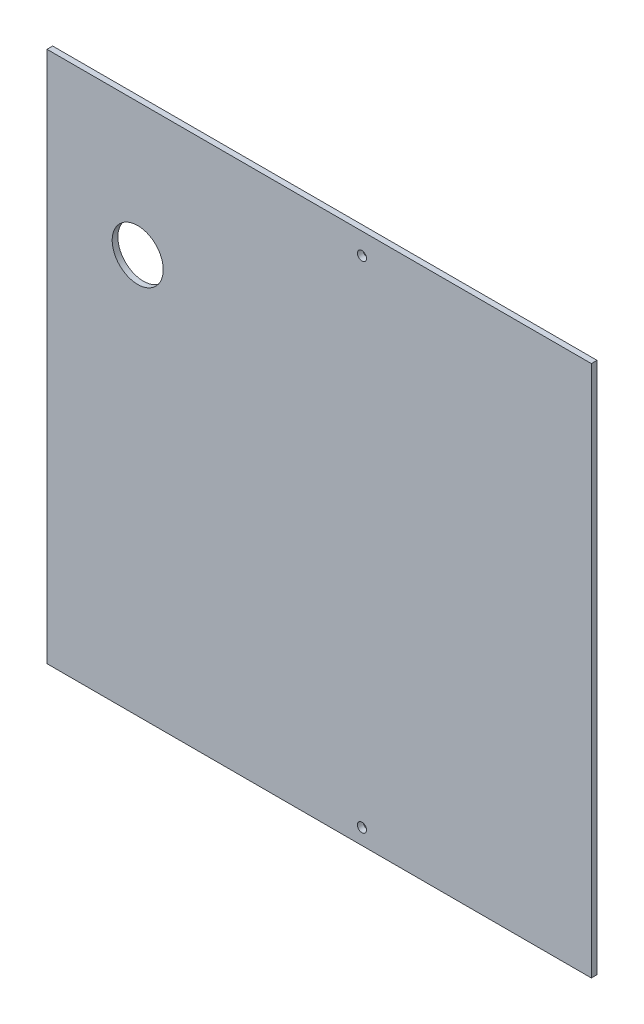
ISO-10303-21;
HEADER;
FILE_DESCRIPTION(('STEP AP214'),'2;1');
FILE_NAME('part.step','',(''),(''),'','','');
FILE_SCHEMA(('AUTOMOTIVE_DESIGN { 1 0 10303 214 1 1 1 1 }'));
ENDSEC;
DATA;
#1=APPLICATION_CONTEXT('core data for automotive mechanical design processes');
#2=APPLICATION_PROTOCOL_DEFINITION('international standard','automotive_design',2000,#1);
#3=PRODUCT_CONTEXT('',#1,'mechanical');
#4=PRODUCT('Part','Part','',(#3));
#5=PRODUCT_RELATED_PRODUCT_CATEGORY('part','',(#4));
#6=PRODUCT_DEFINITION_FORMATION('','',#4);
#7=PRODUCT_DEFINITION_CONTEXT('part definition',#1,'design');
#8=PRODUCT_DEFINITION('design','',#6,#7);
#9=PRODUCT_DEFINITION_SHAPE('','',#8);
#10=(LENGTH_UNIT() NAMED_UNIT(*) SI_UNIT(.MILLI.,.METRE.));
#11=(NAMED_UNIT(*) PLANE_ANGLE_UNIT() SI_UNIT($,.RADIAN.));
#12=(NAMED_UNIT(*) SI_UNIT($,.STERADIAN.) SOLID_ANGLE_UNIT());
#13=UNCERTAINTY_MEASURE_WITH_UNIT(LENGTH_MEASURE(1.E-05),#10,'distance_accuracy_value','');
#14=(GEOMETRIC_REPRESENTATION_CONTEXT(3) GLOBAL_UNCERTAINTY_ASSIGNED_CONTEXT((#13)) GLOBAL_UNIT_ASSIGNED_CONTEXT((#10,
#11,#12)) REPRESENTATION_CONTEXT('',''));
#15=CARTESIAN_POINT('',(0.,0.,0.));
#16=DIRECTION('',(0.,0.,1.));
#17=DIRECTION('',(1.,0.,0.));
#18=AXIS2_PLACEMENT_3D('',#15,#16,#17);
#19=CARTESIAN_POINT('',(0.,0.,-3.175));
#20=DIRECTION('',(0.,0.,-1.));
#21=DIRECTION('',(-1.,0.,0.));
#22=AXIS2_PLACEMENT_3D('',#19,#20,#21);
#23=PLANE('',#22);
#24=CARTESIAN_POINT('',(50.8,203.2,-3.175));
#25=DIRECTION('',(0.,0.,1.));
#26=DIRECTION('',(1.,0.,0.));
#27=AXIS2_PLACEMENT_3D('',#24,#25,#26);
#28=CIRCLE('',#27,14.2875);
#29=CARTESIAN_POINT('',(65.0875,203.2,-3.175));
#30=VERTEX_POINT('',#29);
#31=EDGE_CURVE('E136',#30,#30,#28,.T.);
#32=ORIENTED_EDGE('',*,*,#31,.T.);
#33=EDGE_LOOP('',(#32));
#34=FACE_BOUND('',#33,.T.);
#35=DIRECTION('',(0.,1.,0.));
#36=VECTOR('',#35,1.);
#37=CARTESIAN_POINT('',(304.8,0.,-3.175));
#38=LINE('',#37,#36);
#39=CARTESIAN_POINT('',(304.8,-20.3796504257165,-3.17500000000015));
#40=VERTEX_POINT('',#39);
#41=CARTESIAN_POINT('',(304.8,277.554650425716,-3.17500000000021));
#42=VERTEX_POINT('',#41);
#43=EDGE_CURVE('E13',#40,#42,#38,.T.);
#44=ORIENTED_EDGE('',*,*,#43,.F.);
#45=DIRECTION('',(1.,0.,0.));
#46=VECTOR('',#45,1.);
#47=CARTESIAN_POINT('',(304.8,-20.3796504257165,-3.17500000000015));
#48=LINE('',#47,#46);
#49=CARTESIAN_POINT('',(-1.11022302462516E-13,-20.3796504257165,-3.17500000000015));
#50=VERTEX_POINT('',#49);
#51=EDGE_CURVE('E148',#50,#40,#48,.T.);
#52=ORIENTED_EDGE('',*,*,#51,.F.);
#53=DIRECTION('',(0.,-1.,0.));
#54=VECTOR('',#53,1.);
#55=CARTESIAN_POINT('',(0.,0.,-3.175));
#56=LINE('',#55,#54);
#57=CARTESIAN_POINT('',(0.,277.554650425716,-3.17500000000021));
#58=VERTEX_POINT('',#57);
#59=EDGE_CURVE('E93',#58,#50,#56,.T.);
#60=ORIENTED_EDGE('',*,*,#59,.F.);
#61=DIRECTION('',(-1.,0.,0.));
#62=VECTOR('',#61,1.);
#63=CARTESIAN_POINT('',(0.,277.554650425716,-3.17500000000021));
#64=LINE('',#63,#62);
#65=EDGE_CURVE('E141',#42,#58,#64,.T.);
#66=ORIENTED_EDGE('',*,*,#65,.F.);
#67=EDGE_LOOP('',(#44,#52,#60,#66));
#68=FACE_BOUND('',#67,.T.);
#69=CARTESIAN_POINT('',(176.357146134279,-11.5912504257176,-3.17500000000015));
#70=DIRECTION('',(0.,0.,1.));
#71=DIRECTION('',(0.,-1.,0.));
#72=AXIS2_PLACEMENT_3D('',#69,#70,#71);
#73=CIRCLE('',#72,2.55269999999998);
#74=CARTESIAN_POINT('',(176.357146134279,-14.1439504257176,-3.17500000000015));
#75=VERTEX_POINT('',#74);
#76=EDGE_CURVE('E163',#75,#75,#73,.T.);
#77=ORIENTED_EDGE('',*,*,#76,.T.);
#78=EDGE_LOOP('',(#77));
#79=FACE_BOUND('',#78,.T.);
#80=CARTESIAN_POINT('',(176.357146134279,265.591250425717,-3.17500000000009));
#81=DIRECTION('',(0.,0.,-1.));
#82=DIRECTION('',(0.,1.,0.));
#83=AXIS2_PLACEMENT_3D('',#80,#81,#82);
#84=CIRCLE('',#83,2.55269999999998);
#85=CARTESIAN_POINT('',(176.357146134279,268.143950425716,-3.17500000000011));
#86=VERTEX_POINT('',#85);
#87=EDGE_CURVE('E142',#86,#86,#84,.T.);
#88=ORIENTED_EDGE('',*,*,#87,.F.);
#89=EDGE_LOOP('',(#88));
#90=FACE_BOUND('',#89,.T.);
#91=ADVANCED_FACE('F83',(#34,#68,#79,#90),#23,.T.);
#92=CARTESIAN_POINT('',(0.,0.,0.));
#93=DIRECTION('',(0.,0.,-1.));
#94=DIRECTION('',(-1.,0.,0.));
#95=AXIS2_PLACEMENT_3D('',#92,#93,#94);
#96=PLANE('',#95);
#97=CARTESIAN_POINT('',(50.8,203.2,0.));
#98=DIRECTION('',(0.,0.,1.));
#99=DIRECTION('',(1.,0.,0.));
#100=AXIS2_PLACEMENT_3D('',#97,#98,#99);
#101=CIRCLE('',#100,14.2875);
#102=CARTESIAN_POINT('',(65.0875,203.2,0.));
#103=VERTEX_POINT('',#102);
#104=EDGE_CURVE('E157',#103,#103,#101,.T.);
#105=ORIENTED_EDGE('',*,*,#104,.F.);
#106=EDGE_LOOP('',(#105));
#107=FACE_BOUND('',#106,.T.);
#108=DIRECTION('',(0.,-1.,0.));
#109=VECTOR('',#108,1.);
#110=CARTESIAN_POINT('',(0.,0.,0.));
#111=LINE('',#110,#109);
#112=CARTESIAN_POINT('',(0.,277.554650425717,-2.22044604925031E-13));
#113=VERTEX_POINT('',#112);
#114=CARTESIAN_POINT('',(-1.11022302462516E-13,-20.3796504257165,-1.50487261540988E-13));
#115=VERTEX_POINT('',#114);
#116=EDGE_CURVE('E126',#113,#115,#111,.T.);
#117=ORIENTED_EDGE('',*,*,#116,.T.);
#118=DIRECTION('',(-1.,0.,0.));
#119=VECTOR('',#118,1.);
#120=CARTESIAN_POINT('',(0.,-20.3796504257165,-1.50487261540988E-13));
#121=LINE('',#120,#119);
#122=CARTESIAN_POINT('',(304.8,-20.3796504257165,-1.50487261540988E-13));
#123=VERTEX_POINT('',#122);
#124=EDGE_CURVE('E158',#115,#123,#121,.F.);
#125=ORIENTED_EDGE('',*,*,#124,.T.);
#126=DIRECTION('',(0.,1.,0.));
#127=VECTOR('',#126,1.);
#128=CARTESIAN_POINT('',(304.8,0.,0.));
#129=LINE('',#128,#127);
#130=CARTESIAN_POINT('',(304.8,277.554650425717,-2.22044604925031E-13));
#131=VERTEX_POINT('',#130);
#132=EDGE_CURVE('E87',#123,#131,#129,.T.);
#133=ORIENTED_EDGE('',*,*,#132,.T.);
#134=DIRECTION('',(1.,0.,0.));
#135=VECTOR('',#134,1.);
#136=CARTESIAN_POINT('',(0.,277.554650425717,-2.22044604925031E-13));
#137=LINE('',#136,#135);
#138=EDGE_CURVE('E140',#131,#113,#137,.F.);
#139=ORIENTED_EDGE('',*,*,#138,.T.);
#140=EDGE_LOOP('',(#117,#125,#133,#139));
#141=FACE_BOUND('',#140,.T.);
#142=CARTESIAN_POINT('',(176.357146134279,-11.5912504257176,0.));
#143=DIRECTION('',(0.,0.,-1.));
#144=DIRECTION('',(0.,1.,0.));
#145=AXIS2_PLACEMENT_3D('',#142,#143,#144);
#146=CIRCLE('',#145,2.55269999999998);
#147=CARTESIAN_POINT('',(176.357146134279,-9.03855042571758,0.));
#148=VERTEX_POINT('',#147);
#149=EDGE_CURVE('E160',#148,#148,#146,.T.);
#150=ORIENTED_EDGE('',*,*,#149,.T.);
#151=EDGE_LOOP('',(#150));
#152=FACE_BOUND('',#151,.T.);
#153=CARTESIAN_POINT('',(176.357146134279,265.591250425717,-1.11022302462516E-13));
#154=DIRECTION('',(0.,0.,-1.));
#155=DIRECTION('',(0.,1.,0.));
#156=AXIS2_PLACEMENT_3D('',#153,#154,#155);
#157=CIRCLE('',#156,2.55269999999998);
#158=CARTESIAN_POINT('',(176.357146134279,268.143950425716,-1.31092748273663E-13));
#159=VERTEX_POINT('',#158);
#160=EDGE_CURVE('E146',#159,#159,#157,.T.);
#161=ORIENTED_EDGE('',*,*,#160,.T.);
#162=EDGE_LOOP('',(#161));
#163=FACE_BOUND('',#162,.T.);
#164=ADVANCED_FACE('F85',(#107,#141,#152,#163),#96,.F.);
#165=CARTESIAN_POINT('',(304.8,0.,-3.175));
#166=DIRECTION('',(1.,0.,0.));
#167=DIRECTION('',(0.,0.,-1.));
#168=AXIS2_PLACEMENT_3D('',#165,#166,#167);
#169=PLANE('',#168);
#170=ORIENTED_EDGE('',*,*,#132,.F.);
#171=DIRECTION('',(0.,0.,1.));
#172=VECTOR('',#171,1.);
#173=CARTESIAN_POINT('',(304.8,-20.3796504257165,-3.17500000000015));
#174=LINE('',#173,#172);
#175=EDGE_CURVE('E166',#40,#123,#174,.T.);
#176=ORIENTED_EDGE('',*,*,#175,.F.);
#177=ORIENTED_EDGE('',*,*,#43,.T.);
#178=DIRECTION('',(0.,0.,1.));
#179=VECTOR('',#178,1.);
#180=CARTESIAN_POINT('',(304.8,277.554650425716,-3.17500000000021));
#181=LINE('',#180,#179);
#182=EDGE_CURVE('E145',#42,#131,#181,.T.);
#183=ORIENTED_EDGE('',*,*,#182,.T.);
#184=EDGE_LOOP('',(#170,#176,#177,#183));
#185=FACE_BOUND('',#184,.T.);
#186=ADVANCED_FACE('F179',(#185),#169,.T.);
#187=CARTESIAN_POINT('',(0.,0.,-3.175));
#188=DIRECTION('',(-1.,0.,0.));
#189=DIRECTION('',(0.,0.,1.));
#190=AXIS2_PLACEMENT_3D('',#187,#188,#189);
#191=PLANE('',#190);
#192=ORIENTED_EDGE('',*,*,#59,.T.);
#193=DIRECTION('',(0.,0.,1.));
#194=VECTOR('',#193,1.);
#195=CARTESIAN_POINT('',(-1.11022302462516E-13,-20.3796504257165,-3.17500000000015));
#196=LINE('',#195,#194);
#197=EDGE_CURVE('E131',#50,#115,#196,.T.);
#198=ORIENTED_EDGE('',*,*,#197,.T.);
#199=ORIENTED_EDGE('',*,*,#116,.F.);
#200=DIRECTION('',(0.,0.,1.));
#201=VECTOR('',#200,1.);
#202=CARTESIAN_POINT('',(0.,277.554650425716,-3.17500000000021));
#203=LINE('',#202,#201);
#204=EDGE_CURVE('E129',#58,#113,#203,.T.);
#205=ORIENTED_EDGE('',*,*,#204,.F.);
#206=EDGE_LOOP('',(#192,#198,#199,#205));
#207=FACE_BOUND('',#206,.T.);
#208=ADVANCED_FACE('F128',(#207),#191,.T.);
#209=CARTESIAN_POINT('',(50.8,203.2,-3.175));
#210=DIRECTION('',(0.,0.,1.));
#211=DIRECTION('',(1.,0.,0.));
#212=AXIS2_PLACEMENT_3D('',#209,#210,#211);
#213=CYLINDRICAL_SURFACE('',#212,14.2875);
#214=ORIENTED_EDGE('',*,*,#31,.F.);
#215=EDGE_LOOP('',(#214));
#216=FACE_BOUND('',#215,.T.);
#217=ORIENTED_EDGE('',*,*,#104,.T.);
#218=EDGE_LOOP('',(#217));
#219=FACE_BOUND('',#218,.T.);
#220=ADVANCED_FACE('F176',(#216,#219),#213,.F.);
#221=CARTESIAN_POINT('',(304.8,-20.3796504257165,-3.17500000000015));
#222=DIRECTION('',(0.,-1.,0.));
#223=DIRECTION('',(0.,0.,-1.));
#224=AXIS2_PLACEMENT_3D('',#221,#222,#223);
#225=PLANE('',#224);
#226=ORIENTED_EDGE('',*,*,#124,.F.);
#227=ORIENTED_EDGE('',*,*,#197,.F.);
#228=ORIENTED_EDGE('',*,*,#51,.T.);
#229=ORIENTED_EDGE('',*,*,#175,.T.);
#230=EDGE_LOOP('',(#226,#227,#228,#229));
#231=FACE_BOUND('',#230,.T.);
#232=ADVANCED_FACE('F195',(#231),#225,.T.);
#233=CARTESIAN_POINT('',(176.357146134279,-11.5912504257176,-3.17500000000015));
#234=DIRECTION('',(0.,0.,1.));
#235=DIRECTION('',(0.,-1.,0.));
#236=AXIS2_PLACEMENT_3D('',#233,#234,#235);
#237=CYLINDRICAL_SURFACE('',#236,2.55269999999998);
#238=ORIENTED_EDGE('',*,*,#76,.F.);
#239=EDGE_LOOP('',(#238));
#240=FACE_BOUND('',#239,.T.);
#241=ORIENTED_EDGE('',*,*,#149,.F.);
#242=EDGE_LOOP('',(#241));
#243=FACE_BOUND('',#242,.T.);
#244=ADVANCED_FACE('F200',(#240,#243),#237,.F.);
#245=CARTESIAN_POINT('',(0.,277.554650425716,-3.17500000000021));
#246=DIRECTION('',(0.,1.,0.));
#247=DIRECTION('',(0.,0.,1.));
#248=AXIS2_PLACEMENT_3D('',#245,#246,#247);
#249=PLANE('',#248);
#250=ORIENTED_EDGE('',*,*,#138,.F.);
#251=ORIENTED_EDGE('',*,*,#182,.F.);
#252=ORIENTED_EDGE('',*,*,#65,.T.);
#253=ORIENTED_EDGE('',*,*,#204,.T.);
#254=EDGE_LOOP('',(#250,#251,#252,#253));
#255=FACE_BOUND('',#254,.T.);
#256=ADVANCED_FACE('F139',(#255),#249,.T.);
#257=CARTESIAN_POINT('',(176.357146134279,265.591250425718,250.825));
#258=DIRECTION('',(0.,0.,-1.));
#259=DIRECTION('',(0.,1.,0.));
#260=AXIS2_PLACEMENT_3D('',#257,#258,#259);
#261=CYLINDRICAL_SURFACE('',#260,2.55269999999998);
#262=ORIENTED_EDGE('',*,*,#87,.T.);
#263=EDGE_LOOP('',(#262));
#264=FACE_BOUND('',#263,.T.);
#265=ORIENTED_EDGE('',*,*,#160,.F.);
#266=EDGE_LOOP('',(#265));
#267=FACE_BOUND('',#266,.T.);
#268=ADVANCED_FACE('F209',(#264,#267),#261,.F.);
#269=CLOSED_SHELL('',(#91,#164,#186,#208,#220,#232,#244,#256,#268));
#270=MANIFOLD_SOLID_BREP('B2',#269);
#271=ADVANCED_BREP_SHAPE_REPRESENTATION('',(#18,#270),#14);
#272=SHAPE_DEFINITION_REPRESENTATION(#9,#271);
ENDSEC;
END-ISO-10303-21;
